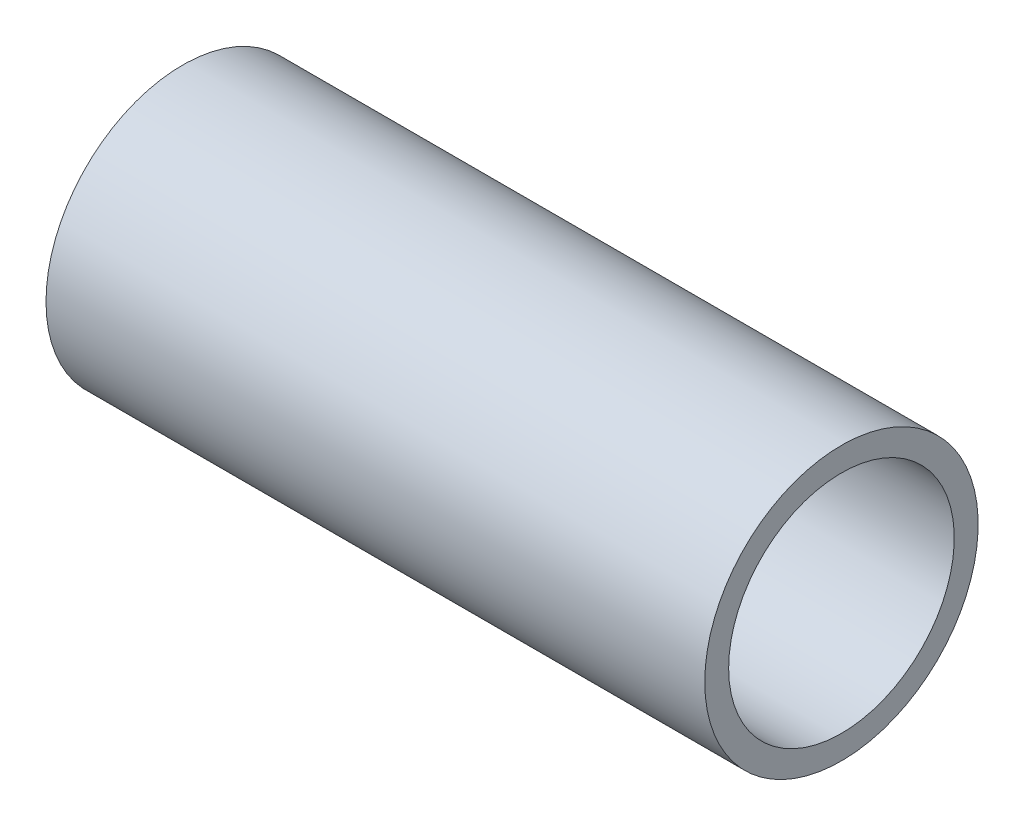
ISO-10303-21;
HEADER;
FILE_DESCRIPTION(('STEP AP214'),'2;1');
FILE_NAME('part.step','',(''),(''),'','','');
FILE_SCHEMA(('AUTOMOTIVE_DESIGN { 1 0 10303 214 1 1 1 1 }'));
ENDSEC;
DATA;
#1=APPLICATION_CONTEXT('core data for automotive mechanical design processes');
#2=APPLICATION_PROTOCOL_DEFINITION('international standard','automotive_design',2000,#1);
#3=PRODUCT_CONTEXT('',#1,'mechanical');
#4=PRODUCT('Part','Part','',(#3));
#5=PRODUCT_RELATED_PRODUCT_CATEGORY('part','',(#4));
#6=PRODUCT_DEFINITION_FORMATION('','',#4);
#7=PRODUCT_DEFINITION_CONTEXT('part definition',#1,'design');
#8=PRODUCT_DEFINITION('design','',#6,#7);
#9=PRODUCT_DEFINITION_SHAPE('','',#8);
#10=(LENGTH_UNIT() NAMED_UNIT(*) SI_UNIT(.MILLI.,.METRE.));
#11=(NAMED_UNIT(*) PLANE_ANGLE_UNIT() SI_UNIT($,.RADIAN.));
#12=(NAMED_UNIT(*) SI_UNIT($,.STERADIAN.) SOLID_ANGLE_UNIT());
#13=UNCERTAINTY_MEASURE_WITH_UNIT(LENGTH_MEASURE(1.E-05),#10,'distance_accuracy_value','');
#14=(GEOMETRIC_REPRESENTATION_CONTEXT(3) GLOBAL_UNCERTAINTY_ASSIGNED_CONTEXT((#13)) GLOBAL_UNIT_ASSIGNED_CONTEXT((#10,
#11,#12)) REPRESENTATION_CONTEXT('',''));
#15=CARTESIAN_POINT('',(0.,0.,0.));
#16=DIRECTION('',(0.,0.,1.));
#17=DIRECTION('',(1.,0.,0.));
#18=AXIS2_PLACEMENT_3D('',#15,#16,#17);
#19=CARTESIAN_POINT('',(0.,21.082,0.));
#20=DIRECTION('',(1.,0.,0.));
#21=DIRECTION('',(0.,0.,-1.));
#22=AXIS2_PLACEMENT_3D('',#19,#20,#21);
#23=PLANE('',#22);
#24=CARTESIAN_POINT('',(0.,0.,0.));
#25=DIRECTION('',(-1.,0.,0.));
#26=DIRECTION('',(0.,0.,1.));
#27=AXIS2_PLACEMENT_3D('',#24,#25,#26);
#28=CIRCLE('',#27,17.399);
#29=CARTESIAN_POINT('',(0.,0.,17.399));
#30=VERTEX_POINT('',#29);
#31=EDGE_CURVE('E10',#30,#30,#28,.T.);
#32=ORIENTED_EDGE('',*,*,#31,.F.);
#33=EDGE_LOOP('',(#32));
#34=FACE_BOUND('',#33,.T.);
#35=CARTESIAN_POINT('',(0.,0.,0.));
#36=DIRECTION('',(-1.,0.,0.));
#37=DIRECTION('',(0.,0.,1.));
#38=AXIS2_PLACEMENT_3D('',#35,#36,#37);
#39=CIRCLE('',#38,21.082);
#40=CARTESIAN_POINT('',(0.,0.,21.082));
#41=VERTEX_POINT('',#40);
#42=EDGE_CURVE('E45',#41,#41,#39,.T.);
#43=ORIENTED_EDGE('',*,*,#42,.T.);
#44=EDGE_LOOP('',(#43));
#45=FACE_BOUND('',#44,.T.);
#46=ADVANCED_FACE('F31',(#34,#45),#23,.F.);
#47=CARTESIAN_POINT('',(-19.5697890295359,0.,0.));
#48=DIRECTION('',(-1.,0.,0.));
#49=DIRECTION('',(0.,0.,1.));
#50=AXIS2_PLACEMENT_3D('',#47,#48,#49);
#51=CYLINDRICAL_SURFACE('',#50,17.399);
#52=CARTESIAN_POINT('',(101.6,0.,0.));
#53=DIRECTION('',(-1.,0.,0.));
#54=DIRECTION('',(0.,0.,1.));
#55=AXIS2_PLACEMENT_3D('',#52,#53,#54);
#56=CIRCLE('',#55,17.399);
#57=CARTESIAN_POINT('',(101.6,0.,17.399));
#58=VERTEX_POINT('',#57);
#59=EDGE_CURVE('E37',#58,#58,#56,.T.);
#60=ORIENTED_EDGE('',*,*,#59,.F.);
#61=EDGE_LOOP('',(#60));
#62=FACE_BOUND('',#61,.T.);
#63=ORIENTED_EDGE('',*,*,#31,.T.);
#64=EDGE_LOOP('',(#63));
#65=FACE_BOUND('',#64,.T.);
#66=ADVANCED_FACE('F60',(#62,#65),#51,.F.);
#67=CARTESIAN_POINT('',(101.6,21.082,0.));
#68=DIRECTION('',(-1.,0.,0.));
#69=DIRECTION('',(0.,0.,1.));
#70=AXIS2_PLACEMENT_3D('',#67,#68,#69);
#71=PLANE('',#70);
#72=CARTESIAN_POINT('',(101.6,0.,0.));
#73=DIRECTION('',(-1.,0.,0.));
#74=DIRECTION('',(0.,0.,1.));
#75=AXIS2_PLACEMENT_3D('',#72,#73,#74);
#76=CIRCLE('',#75,21.082);
#77=CARTESIAN_POINT('',(101.6,0.,21.082));
#78=VERTEX_POINT('',#77);
#79=EDGE_CURVE('E41',#78,#78,#76,.T.);
#80=ORIENTED_EDGE('',*,*,#79,.F.);
#81=EDGE_LOOP('',(#80));
#82=FACE_BOUND('',#81,.T.);
#83=ORIENTED_EDGE('',*,*,#59,.T.);
#84=EDGE_LOOP('',(#83));
#85=FACE_BOUND('',#84,.T.);
#86=ADVANCED_FACE('F55',(#82,#85),#71,.F.);
#87=CARTESIAN_POINT('',(-19.5697890295359,0.,0.));
#88=DIRECTION('',(-1.,0.,0.));
#89=DIRECTION('',(0.,0.,1.));
#90=AXIS2_PLACEMENT_3D('',#87,#88,#89);
#91=CYLINDRICAL_SURFACE('',#90,21.082);
#92=ORIENTED_EDGE('',*,*,#42,.F.);
#93=EDGE_LOOP('',(#92));
#94=FACE_BOUND('',#93,.T.);
#95=ORIENTED_EDGE('',*,*,#79,.T.);
#96=EDGE_LOOP('',(#95));
#97=FACE_BOUND('',#96,.T.);
#98=ADVANCED_FACE('F52',(#94,#97),#91,.T.);
#99=CLOSED_SHELL('',(#46,#66,#86,#98));
#100=MANIFOLD_SOLID_BREP('B2',#99);
#101=ADVANCED_BREP_SHAPE_REPRESENTATION('',(#18,#100),#14);
#102=SHAPE_DEFINITION_REPRESENTATION(#9,#101);
ENDSEC;
END-ISO-10303-21;
